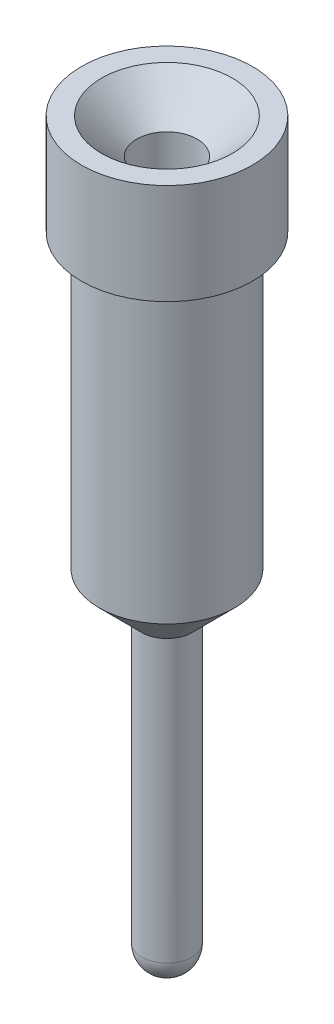
ISO-10303-21;
HEADER;
FILE_DESCRIPTION(('STEP AP214'),'2;1');
FILE_NAME('part.step','',(''),(''),'','','');
FILE_SCHEMA(('AUTOMOTIVE_DESIGN { 1 0 10303 214 1 1 1 1 }'));
ENDSEC;
DATA;
#1=APPLICATION_CONTEXT('core data for automotive mechanical design processes');
#2=APPLICATION_PROTOCOL_DEFINITION('international standard','automotive_design',2000,#1);
#3=PRODUCT_CONTEXT('',#1,'mechanical');
#4=PRODUCT('Part','Part','',(#3));
#5=PRODUCT_RELATED_PRODUCT_CATEGORY('part','',(#4));
#6=PRODUCT_DEFINITION_FORMATION('','',#4);
#7=PRODUCT_DEFINITION_CONTEXT('part definition',#1,'design');
#8=PRODUCT_DEFINITION('design','',#6,#7);
#9=PRODUCT_DEFINITION_SHAPE('','',#8);
#10=(LENGTH_UNIT() NAMED_UNIT(*) SI_UNIT(.MILLI.,.METRE.));
#11=(NAMED_UNIT(*) PLANE_ANGLE_UNIT() SI_UNIT($,.RADIAN.));
#12=(NAMED_UNIT(*) SI_UNIT($,.STERADIAN.) SOLID_ANGLE_UNIT());
#13=UNCERTAINTY_MEASURE_WITH_UNIT(LENGTH_MEASURE(1.E-05),#10,'distance_accuracy_value','');
#14=(GEOMETRIC_REPRESENTATION_CONTEXT(3) GLOBAL_UNCERTAINTY_ASSIGNED_CONTEXT((#13)) GLOBAL_UNIT_ASSIGNED_CONTEXT((#10,
#11,#12)) REPRESENTATION_CONTEXT('',''));
#15=CARTESIAN_POINT('',(0.,0.,0.));
#16=DIRECTION('',(0.,0.,1.));
#17=DIRECTION('',(1.,0.,0.));
#18=AXIS2_PLACEMENT_3D('',#15,#16,#17);
#19=CARTESIAN_POINT('',(0.,-7.12,0.));
#20=DIRECTION('',(0.,1.,0.));
#21=DIRECTION('',(1.,0.,0.));
#22=AXIS2_PLACEMENT_3D('',#19,#20,#21);
#23=SPHERICAL_SURFACE('',#22,0.25);
#24=CARTESIAN_POINT('',(2.5E-09,-7.37,0.));
#25=VERTEX_POINT('',#24);
#26=VERTEX_LOOP('',#25);
#27=FACE_BOUND('',#26,.T.);
#28=CARTESIAN_POINT('',(0.,-7.12,0.));
#29=DIRECTION('',(0.,1.,0.));
#30=DIRECTION('',(0.,0.,1.));
#31=AXIS2_PLACEMENT_3D('',#28,#29,#30);
#32=CIRCLE('',#31,0.25);
#33=CARTESIAN_POINT('',(0.,-7.12,0.25));
#34=VERTEX_POINT('',#33);
#35=EDGE_CURVE('E39',#34,#34,#32,.F.);
#36=ORIENTED_EDGE('',*,*,#35,.T.);
#37=EDGE_LOOP('',(#36));
#38=FACE_BOUND('',#37,.T.);
#39=ADVANCED_FACE('F17',(#27,#38),#23,.T.);
#40=CARTESIAN_POINT('',(0.,-7.12,0.));
#41=DIRECTION('',(0.,1.,0.));
#42=DIRECTION('',(0.,0.,1.));
#43=AXIS2_PLACEMENT_3D('',#40,#41,#42);
#44=CYLINDRICAL_SURFACE('',#43,0.25);
#45=ORIENTED_EDGE('',*,*,#35,.F.);
#46=EDGE_LOOP('',(#45));
#47=FACE_BOUND('',#46,.T.);
#48=CARTESIAN_POINT('',(0.,-4.32500000000002,0.));
#49=DIRECTION('',(0.,1.,0.));
#50=DIRECTION('',(0.,0.,1.));
#51=AXIS2_PLACEMENT_3D('',#48,#49,#50);
#52=CIRCLE('',#51,0.25);
#53=CARTESIAN_POINT('',(0.,-4.325,0.25));
#54=VERTEX_POINT('',#53);
#55=EDGE_CURVE('E41',#54,#54,#52,.F.);
#56=ORIENTED_EDGE('',*,*,#55,.T.);
#57=EDGE_LOOP('',(#56));
#58=FACE_BOUND('',#57,.T.);
#59=ADVANCED_FACE('F35',(#47,#58),#44,.T.);
#60=CARTESIAN_POINT('',(0.,-4.325,0.));
#61=DIRECTION('',(0.,1.,0.));
#62=DIRECTION('',(0.,0.,1.));
#63=AXIS2_PLACEMENT_3D('',#60,#61,#62);
#64=CONICAL_SURFACE('',#63,0.25,0.78539816339745);
#65=ORIENTED_EDGE('',*,*,#55,.F.);
#66=EDGE_LOOP('',(#65));
#67=FACE_BOUND('',#66,.T.);
#68=CARTESIAN_POINT('',(0.,-3.9,0.));
#69=DIRECTION('',(0.,1.,0.));
#70=DIRECTION('',(0.,0.,1.));
#71=AXIS2_PLACEMENT_3D('',#68,#69,#70);
#72=CIRCLE('',#71,0.675);
#73=CARTESIAN_POINT('',(0.,-3.9,0.675));
#74=VERTEX_POINT('',#73);
#75=EDGE_CURVE('E44',#74,#74,#72,.F.);
#76=ORIENTED_EDGE('',*,*,#75,.T.);
#77=EDGE_LOOP('',(#76));
#78=FACE_BOUND('',#77,.T.);
#79=ADVANCED_FACE('F84',(#67,#78),#64,.T.);
#80=CARTESIAN_POINT('',(0.,-3.9,0.));
#81=DIRECTION('',(0.,1.,0.));
#82=DIRECTION('',(0.,0.,1.));
#83=AXIS2_PLACEMENT_3D('',#80,#81,#82);
#84=CYLINDRICAL_SURFACE('',#83,0.675);
#85=ORIENTED_EDGE('',*,*,#75,.F.);
#86=EDGE_LOOP('',(#85));
#87=FACE_BOUND('',#86,.T.);
#88=CARTESIAN_POINT('',(0.,-1.,0.));
#89=DIRECTION('',(0.,1.,0.));
#90=DIRECTION('',(0.,0.,1.));
#91=AXIS2_PLACEMENT_3D('',#88,#89,#90);
#92=CIRCLE('',#91,0.675);
#93=CARTESIAN_POINT('',(0.,-1.,0.675));
#94=VERTEX_POINT('',#93);
#95=EDGE_CURVE('E21',#94,#94,#92,.T.);
#96=ORIENTED_EDGE('',*,*,#95,.F.);
#97=EDGE_LOOP('',(#96));
#98=FACE_BOUND('',#97,.T.);
#99=ADVANCED_FACE('F65',(#87,#98),#84,.T.);
#100=CARTESIAN_POINT('',(0.,-4.,0.));
#101=DIRECTION('',(0.,1.,0.));
#102=DIRECTION('',(-1.,0.,0.));
#103=AXIS2_PLACEMENT_3D('',#100,#101,#102);
#104=CONICAL_SURFACE('',#103,0.,0.785398163397449);
#105=CARTESIAN_POINT('',(0.,-4.,0.));
#106=VERTEX_POINT('',#105);
#107=VERTEX_LOOP('',#106);
#108=FACE_BOUND('',#107,.T.);
#109=CARTESIAN_POINT('',(0.,-3.7,0.));
#110=DIRECTION('',(0.,1.,0.));
#111=DIRECTION('',(0.,0.,1.));
#112=AXIS2_PLACEMENT_3D('',#109,#110,#111);
#113=CIRCLE('',#112,0.3);
#114=CARTESIAN_POINT('',(0.,-3.7,0.3));
#115=VERTEX_POINT('',#114);
#116=EDGE_CURVE('E95',#115,#115,#113,.F.);
#117=ORIENTED_EDGE('',*,*,#116,.F.);
#118=EDGE_LOOP('',(#117));
#119=FACE_BOUND('',#118,.T.);
#120=ADVANCED_FACE('F55',(#108,#119),#104,.F.);
#121=CARTESIAN_POINT('',(-0.8602,-1.,0.8602));
#122=DIRECTION('',(0.,-1.,0.));
#123=DIRECTION('',(0.,0.,-1.));
#124=AXIS2_PLACEMENT_3D('',#121,#122,#123);
#125=PLANE('',#124);
#126=ORIENTED_EDGE('',*,*,#95,.T.);
#127=EDGE_LOOP('',(#126));
#128=FACE_BOUND('',#127,.T.);
#129=CARTESIAN_POINT('',(0.,-1.,0.));
#130=DIRECTION('',(0.,1.,0.));
#131=DIRECTION('',(0.,0.,1.));
#132=AXIS2_PLACEMENT_3D('',#129,#130,#131);
#133=CIRCLE('',#132,0.85);
#134=CARTESIAN_POINT('',(0.,-1.,0.85));
#135=VERTEX_POINT('',#134);
#136=EDGE_CURVE('E99',#135,#135,#133,.F.);
#137=ORIENTED_EDGE('',*,*,#136,.T.);
#138=EDGE_LOOP('',(#137));
#139=FACE_BOUND('',#138,.T.);
#140=ADVANCED_FACE('F52',(#128,#139),#125,.T.);
#141=CARTESIAN_POINT('',(0.,-3.7,0.));
#142=DIRECTION('',(0.,1.,0.));
#143=DIRECTION('',(-1.,0.,0.));
#144=AXIS2_PLACEMENT_3D('',#141,#142,#143);
#145=CYLINDRICAL_SURFACE('',#144,0.3);
#146=ORIENTED_EDGE('',*,*,#116,.T.);
#147=EDGE_LOOP('',(#146));
#148=FACE_BOUND('',#147,.T.);
#149=CARTESIAN_POINT('',(0.,-0.349999999999961,0.));
#150=DIRECTION('',(0.,1.,0.));
#151=DIRECTION('',(0.,-1.28658657801613E-13,1.));
#152=AXIS2_PLACEMENT_3D('',#149,#150,#151);
#153=CIRCLE('',#152,0.3);
#154=CARTESIAN_POINT('',(0.,-0.35,0.3));
#155=VERTEX_POINT('',#154);
#156=EDGE_CURVE('E100',#155,#155,#153,.F.);
#157=ORIENTED_EDGE('',*,*,#156,.F.);
#158=EDGE_LOOP('',(#157));
#159=FACE_BOUND('',#158,.T.);
#160=ADVANCED_FACE('F54',(#148,#159),#145,.F.);
#161=CARTESIAN_POINT('',(0.,-1.,0.));
#162=DIRECTION('',(0.,1.,0.));
#163=DIRECTION('',(0.,0.,1.));
#164=AXIS2_PLACEMENT_3D('',#161,#162,#163);
#165=CYLINDRICAL_SURFACE('',#164,0.85);
#166=ORIENTED_EDGE('',*,*,#136,.F.);
#167=EDGE_LOOP('',(#166));
#168=FACE_BOUND('',#167,.T.);
#169=CARTESIAN_POINT('',(0.,0.,0.));
#170=DIRECTION('',(0.,1.,0.));
#171=DIRECTION('',(0.,0.,1.));
#172=AXIS2_PLACEMENT_3D('',#169,#170,#171);
#173=CIRCLE('',#172,0.85);
#174=CARTESIAN_POINT('',(0.,0.,0.85));
#175=VERTEX_POINT('',#174);
#176=EDGE_CURVE('E27',#175,#175,#173,.T.);
#177=ORIENTED_EDGE('',*,*,#176,.F.);
#178=EDGE_LOOP('',(#177));
#179=FACE_BOUND('',#178,.T.);
#180=ADVANCED_FACE('F62',(#168,#179),#165,.T.);
#181=CARTESIAN_POINT('',(-0.8602,0.,-0.8602));
#182=DIRECTION('',(0.,1.,0.));
#183=DIRECTION('',(0.,0.,1.));
#184=AXIS2_PLACEMENT_3D('',#181,#182,#183);
#185=PLANE('',#184);
#186=CARTESIAN_POINT('',(0.,0.,0.));
#187=DIRECTION('',(0.,1.,0.));
#188=DIRECTION('',(0.,0.,1.));
#189=AXIS2_PLACEMENT_3D('',#186,#187,#188);
#190=CIRCLE('',#189,0.65);
#191=CARTESIAN_POINT('',(0.,0.,0.65));
#192=VERTEX_POINT('',#191);
#193=EDGE_CURVE('E11',#192,#192,#190,.T.);
#194=ORIENTED_EDGE('',*,*,#193,.F.);
#195=EDGE_LOOP('',(#194));
#196=FACE_BOUND('',#195,.T.);
#197=ORIENTED_EDGE('',*,*,#176,.T.);
#198=EDGE_LOOP('',(#197));
#199=FACE_BOUND('',#198,.T.);
#200=ADVANCED_FACE('F19',(#196,#199),#185,.T.);
#201=CARTESIAN_POINT('',(0.,-0.35,0.));
#202=DIRECTION('',(0.,1.,0.));
#203=DIRECTION('',(0.,0.,1.));
#204=AXIS2_PLACEMENT_3D('',#201,#202,#203);
#205=CONICAL_SURFACE('',#204,0.3,0.785398163397449);
#206=ORIENTED_EDGE('',*,*,#156,.T.);
#207=EDGE_LOOP('',(#206));
#208=FACE_BOUND('',#207,.T.);
#209=ORIENTED_EDGE('',*,*,#193,.T.);
#210=EDGE_LOOP('',(#209));
#211=FACE_BOUND('',#210,.T.);
#212=ADVANCED_FACE('F69',(#208,#211),#205,.F.);
#213=CLOSED_SHELL('',(#39,#59,#79,#99,#120,#140,#160,#180,#200,#212));
#214=MANIFOLD_SOLID_BREP('B1',#213);
#215=ADVANCED_BREP_SHAPE_REPRESENTATION('',(#18,#214),#14);
#216=SHAPE_DEFINITION_REPRESENTATION(#9,#215);
ENDSEC;
END-ISO-10303-21;
